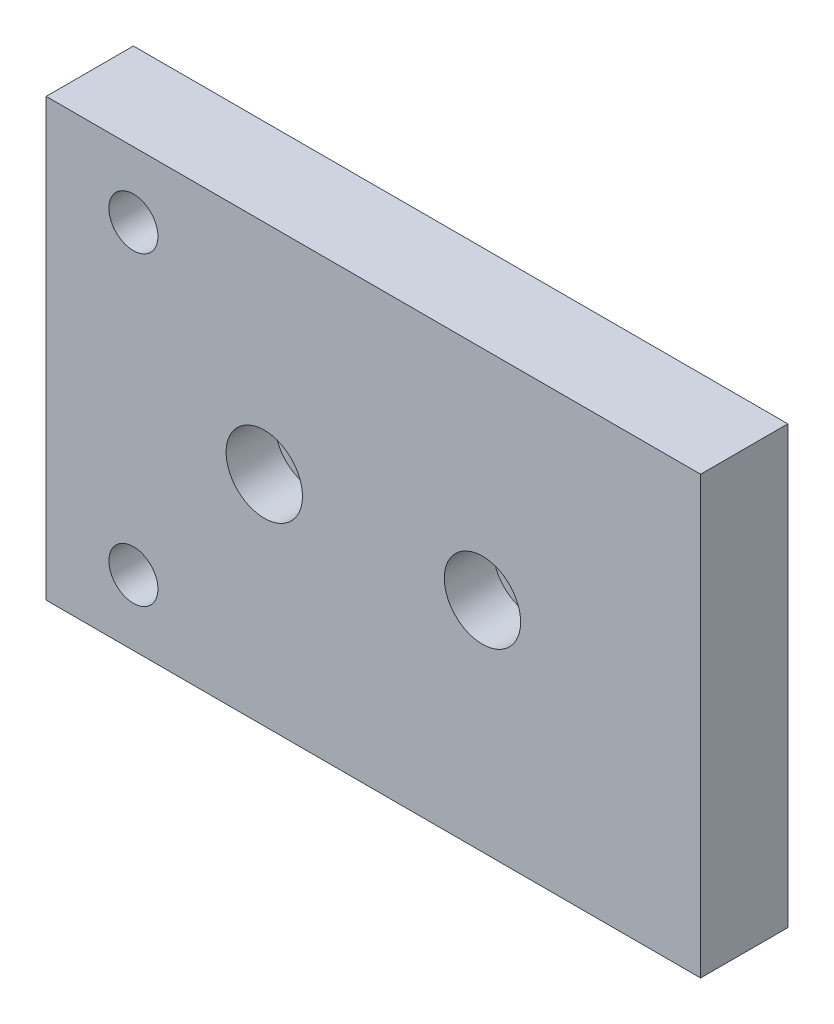
ISO-10303-21;
HEADER;
FILE_DESCRIPTION(('STEP AP214'),'2;1');
FILE_NAME('part.step','',(''),(''),'','','');
FILE_SCHEMA(('AUTOMOTIVE_DESIGN { 1 0 10303 214 1 1 1 1 }'));
ENDSEC;
DATA;
#1=APPLICATION_CONTEXT('core data for automotive mechanical design processes');
#2=APPLICATION_PROTOCOL_DEFINITION('international standard','automotive_design',2000,#1);
#3=PRODUCT_CONTEXT('',#1,'mechanical');
#4=PRODUCT('Part','Part','',(#3));
#5=PRODUCT_RELATED_PRODUCT_CATEGORY('part','',(#4));
#6=PRODUCT_DEFINITION_FORMATION('','',#4);
#7=PRODUCT_DEFINITION_CONTEXT('part definition',#1,'design');
#8=PRODUCT_DEFINITION('design','',#6,#7);
#9=PRODUCT_DEFINITION_SHAPE('','',#8);
#10=(LENGTH_UNIT() NAMED_UNIT(*) SI_UNIT(.MILLI.,.METRE.));
#11=(NAMED_UNIT(*) PLANE_ANGLE_UNIT() SI_UNIT($,.RADIAN.));
#12=(NAMED_UNIT(*) SI_UNIT($,.STERADIAN.) SOLID_ANGLE_UNIT());
#13=UNCERTAINTY_MEASURE_WITH_UNIT(LENGTH_MEASURE(1.E-05),#10,'distance_accuracy_value','');
#14=(GEOMETRIC_REPRESENTATION_CONTEXT(3) GLOBAL_UNCERTAINTY_ASSIGNED_CONTEXT((#13)) GLOBAL_UNIT_ASSIGNED_CONTEXT((#10,
#11,#12)) REPRESENTATION_CONTEXT('',''));
#15=CARTESIAN_POINT('',(0.,0.,0.));
#16=DIRECTION('',(0.,0.,1.));
#17=DIRECTION('',(1.,0.,0.));
#18=AXIS2_PLACEMENT_3D('',#15,#16,#17);
#19=CARTESIAN_POINT('',(0.,0.,12.7));
#20=DIRECTION('',(1.,0.,0.));
#21=DIRECTION('',(0.,0.,-1.));
#22=AXIS2_PLACEMENT_3D('',#19,#20,#21);
#23=PLANE('',#22);
#24=DIRECTION('',(0.,-1.,0.));
#25=VECTOR('',#24,1.);
#26=CARTESIAN_POINT('',(0.,0.,0.));
#27=LINE('',#26,#25);
#28=CARTESIAN_POINT('',(0.,63.5,0.));
#29=VERTEX_POINT('',#28);
#30=CARTESIAN_POINT('',(0.,0.,0.));
#31=VERTEX_POINT('',#30);
#32=EDGE_CURVE('E95',#29,#31,#27,.T.);
#33=ORIENTED_EDGE('',*,*,#32,.T.);
#34=DIRECTION('',(0.,0.,-1.));
#35=VECTOR('',#34,1.);
#36=CARTESIAN_POINT('',(0.,0.,12.7));
#37=LINE('',#36,#35);
#38=CARTESIAN_POINT('',(0.,0.,12.7));
#39=VERTEX_POINT('',#38);
#40=EDGE_CURVE('E11',#39,#31,#37,.T.);
#41=ORIENTED_EDGE('',*,*,#40,.F.);
#42=DIRECTION('',(0.,-1.,0.));
#43=VECTOR('',#42,1.);
#44=CARTESIAN_POINT('',(0.,0.,12.7));
#45=LINE('',#44,#43);
#46=CARTESIAN_POINT('',(0.,63.5,12.7));
#47=VERTEX_POINT('',#46);
#48=EDGE_CURVE('E83',#47,#39,#45,.T.);
#49=ORIENTED_EDGE('',*,*,#48,.F.);
#50=DIRECTION('',(0.,0.,-1.));
#51=VECTOR('',#50,1.);
#52=CARTESIAN_POINT('',(0.,63.5,12.7));
#53=LINE('',#52,#51);
#54=EDGE_CURVE('E91',#47,#29,#53,.T.);
#55=ORIENTED_EDGE('',*,*,#54,.T.);
#56=EDGE_LOOP('',(#33,#41,#49,#55));
#57=FACE_BOUND('',#56,.T.);
#58=ADVANCED_FACE('F32',(#57),#23,.F.);
#59=CARTESIAN_POINT('',(0.,0.,12.7));
#60=DIRECTION('',(0.,1.,0.));
#61=DIRECTION('',(0.,0.,1.));
#62=AXIS2_PLACEMENT_3D('',#59,#60,#61);
#63=PLANE('',#62);
#64=DIRECTION('',(1.,0.,0.));
#65=VECTOR('',#64,1.);
#66=CARTESIAN_POINT('',(0.,0.,0.));
#67=LINE('',#66,#65);
#68=CARTESIAN_POINT('',(95.25,0.,0.));
#69=VERTEX_POINT('',#68);
#70=EDGE_CURVE('E87',#31,#69,#67,.T.);
#71=ORIENTED_EDGE('',*,*,#70,.T.);
#72=DIRECTION('',(0.,0.,-1.));
#73=VECTOR('',#72,1.);
#74=CARTESIAN_POINT('',(95.25,0.,12.7));
#75=LINE('',#74,#73);
#76=CARTESIAN_POINT('',(95.25,0.,12.7));
#77=VERTEX_POINT('',#76);
#78=EDGE_CURVE('E40',#77,#69,#75,.T.);
#79=ORIENTED_EDGE('',*,*,#78,.F.);
#80=DIRECTION('',(1.,0.,0.));
#81=VECTOR('',#80,1.);
#82=CARTESIAN_POINT('',(0.,0.,12.7));
#83=LINE('',#82,#81);
#84=EDGE_CURVE('E78',#39,#77,#83,.T.);
#85=ORIENTED_EDGE('',*,*,#84,.F.);
#86=ORIENTED_EDGE('',*,*,#40,.T.);
#87=EDGE_LOOP('',(#71,#79,#85,#86));
#88=FACE_BOUND('',#87,.T.);
#89=ADVANCED_FACE('F86',(#88),#63,.F.);
#90=CARTESIAN_POINT('',(95.25,0.,12.7));
#91=DIRECTION('',(-1.,0.,0.));
#92=DIRECTION('',(0.,0.,1.));
#93=AXIS2_PLACEMENT_3D('',#90,#91,#92);
#94=PLANE('',#93);
#95=DIRECTION('',(0.,1.,0.));
#96=VECTOR('',#95,1.);
#97=CARTESIAN_POINT('',(95.25,0.,0.));
#98=LINE('',#97,#96);
#99=CARTESIAN_POINT('',(95.25,63.5,0.));
#100=VERTEX_POINT('',#99);
#101=EDGE_CURVE('E65',#69,#100,#98,.T.);
#102=ORIENTED_EDGE('',*,*,#101,.T.);
#103=DIRECTION('',(0.,0.,-1.));
#104=VECTOR('',#103,1.);
#105=CARTESIAN_POINT('',(95.25,63.5,12.7));
#106=LINE('',#105,#104);
#107=CARTESIAN_POINT('',(95.25,63.5,12.7));
#108=VERTEX_POINT('',#107);
#109=EDGE_CURVE('E88',#108,#100,#106,.T.);
#110=ORIENTED_EDGE('',*,*,#109,.F.);
#111=DIRECTION('',(0.,1.,0.));
#112=VECTOR('',#111,1.);
#113=CARTESIAN_POINT('',(95.25,0.,12.7));
#114=LINE('',#113,#112);
#115=EDGE_CURVE('E81',#77,#108,#114,.T.);
#116=ORIENTED_EDGE('',*,*,#115,.F.);
#117=ORIENTED_EDGE('',*,*,#78,.T.);
#118=EDGE_LOOP('',(#102,#110,#116,#117));
#119=FACE_BOUND('',#118,.T.);
#120=ADVANCED_FACE('F89',(#119),#94,.F.);
#121=CARTESIAN_POINT('',(0.,63.5,12.7));
#122=DIRECTION('',(0.,-1.,0.));
#123=DIRECTION('',(0.,0.,-1.));
#124=AXIS2_PLACEMENT_3D('',#121,#122,#123);
#125=PLANE('',#124);
#126=DIRECTION('',(-1.,0.,0.));
#127=VECTOR('',#126,1.);
#128=CARTESIAN_POINT('',(0.,63.5,0.));
#129=LINE('',#128,#127);
#130=EDGE_CURVE('E71',#100,#29,#129,.T.);
#131=ORIENTED_EDGE('',*,*,#130,.T.);
#132=ORIENTED_EDGE('',*,*,#54,.F.);
#133=DIRECTION('',(-1.,0.,0.));
#134=VECTOR('',#133,1.);
#135=CARTESIAN_POINT('',(0.,63.5,12.7));
#136=LINE('',#135,#134);
#137=EDGE_CURVE('E48',#108,#47,#136,.T.);
#138=ORIENTED_EDGE('',*,*,#137,.F.);
#139=ORIENTED_EDGE('',*,*,#109,.T.);
#140=EDGE_LOOP('',(#131,#132,#138,#139));
#141=FACE_BOUND('',#140,.T.);
#142=ADVANCED_FACE('F103',(#141),#125,.F.);
#143=CARTESIAN_POINT('',(0.,63.5,12.7));
#144=DIRECTION('',(0.,0.,-1.));
#145=DIRECTION('',(-1.,0.,0.));
#146=AXIS2_PLACEMENT_3D('',#143,#144,#145);
#147=PLANE('',#146);
#148=CARTESIAN_POINT('',(31.75,31.75,12.7));
#149=DIRECTION('',(0.,0.,1.));
#150=DIRECTION('',(1.,0.,0.));
#151=AXIS2_PLACEMENT_3D('',#148,#149,#150);
#152=CIRCLE('',#151,5.55625);
#153=CARTESIAN_POINT('',(37.30625,31.75,12.7));
#154=VERTEX_POINT('',#153);
#155=EDGE_CURVE('E153',#154,#154,#152,.T.);
#156=ORIENTED_EDGE('',*,*,#155,.F.);
#157=EDGE_LOOP('',(#156));
#158=FACE_BOUND('',#157,.T.);
#159=CARTESIAN_POINT('',(63.5,31.75,12.7));
#160=DIRECTION('',(0.,0.,1.));
#161=DIRECTION('',(1.,0.,0.));
#162=AXIS2_PLACEMENT_3D('',#159,#160,#161);
#163=CIRCLE('',#162,5.55625);
#164=CARTESIAN_POINT('',(69.05625,31.75,12.7));
#165=VERTEX_POINT('',#164);
#166=EDGE_CURVE('E141',#165,#165,#163,.T.);
#167=ORIENTED_EDGE('',*,*,#166,.F.);
#168=EDGE_LOOP('',(#167));
#169=FACE_BOUND('',#168,.T.);
#170=CARTESIAN_POINT('',(12.7,53.975,12.7));
#171=DIRECTION('',(0.,0.,-1.));
#172=DIRECTION('',(-1.,0.,0.));
#173=AXIS2_PLACEMENT_3D('',#170,#171,#172);
#174=CIRCLE('',#173,3.57124);
#175=CARTESIAN_POINT('',(9.12876000000001,53.975,12.7));
#176=VERTEX_POINT('',#175);
#177=EDGE_CURVE('E120',#176,#176,#174,.T.);
#178=ORIENTED_EDGE('',*,*,#177,.T.);
#179=EDGE_LOOP('',(#178));
#180=FACE_BOUND('',#179,.T.);
#181=CARTESIAN_POINT('',(12.7,9.525,12.7));
#182=DIRECTION('',(0.,0.,-1.));
#183=DIRECTION('',(-1.,0.,0.));
#184=AXIS2_PLACEMENT_3D('',#181,#182,#183);
#185=CIRCLE('',#184,3.57124);
#186=CARTESIAN_POINT('',(9.12876,9.525,12.7));
#187=VERTEX_POINT('',#186);
#188=EDGE_CURVE('E98',#187,#187,#185,.T.);
#189=ORIENTED_EDGE('',*,*,#188,.T.);
#190=EDGE_LOOP('',(#189));
#191=FACE_BOUND('',#190,.T.);
#192=ORIENTED_EDGE('',*,*,#48,.T.);
#193=ORIENTED_EDGE('',*,*,#84,.T.);
#194=ORIENTED_EDGE('',*,*,#115,.T.);
#195=ORIENTED_EDGE('',*,*,#137,.T.);
#196=EDGE_LOOP('',(#192,#193,#194,#195));
#197=FACE_BOUND('',#196,.T.);
#198=ADVANCED_FACE('F79',(#158,#169,#180,#191,#197),#147,.F.);
#199=CARTESIAN_POINT('',(0.,63.5,0.));
#200=DIRECTION('',(0.,0.,-1.));
#201=DIRECTION('',(-1.,0.,0.));
#202=AXIS2_PLACEMENT_3D('',#199,#200,#201);
#203=PLANE('',#202);
#204=CARTESIAN_POINT('',(31.75,31.75,0.));
#205=DIRECTION('',(0.,0.,1.));
#206=DIRECTION('',(1.,0.,0.));
#207=AXIS2_PLACEMENT_3D('',#204,#205,#206);
#208=CIRCLE('',#207,3.57124);
#209=CARTESIAN_POINT('',(35.32124,31.75,0.));
#210=VERTEX_POINT('',#209);
#211=EDGE_CURVE('E144',#210,#210,#208,.T.);
#212=ORIENTED_EDGE('',*,*,#211,.T.);
#213=EDGE_LOOP('',(#212));
#214=FACE_BOUND('',#213,.T.);
#215=CARTESIAN_POINT('',(63.5,31.75,0.));
#216=DIRECTION('',(0.,0.,1.));
#217=DIRECTION('',(1.,0.,0.));
#218=AXIS2_PLACEMENT_3D('',#215,#216,#217);
#219=CIRCLE('',#218,3.57124);
#220=CARTESIAN_POINT('',(67.07124,31.75,0.));
#221=VERTEX_POINT('',#220);
#222=EDGE_CURVE('E132',#221,#221,#219,.T.);
#223=ORIENTED_EDGE('',*,*,#222,.T.);
#224=EDGE_LOOP('',(#223));
#225=FACE_BOUND('',#224,.T.);
#226=CARTESIAN_POINT('',(12.7,53.975,0.));
#227=DIRECTION('',(0.,0.,-1.));
#228=DIRECTION('',(-1.,0.,0.));
#229=AXIS2_PLACEMENT_3D('',#226,#227,#228);
#230=CIRCLE('',#229,5.55625);
#231=CARTESIAN_POINT('',(7.14375000000001,53.975,0.));
#232=VERTEX_POINT('',#231);
#233=EDGE_CURVE('E129',#232,#232,#230,.T.);
#234=ORIENTED_EDGE('',*,*,#233,.F.);
#235=EDGE_LOOP('',(#234));
#236=FACE_BOUND('',#235,.T.);
#237=CARTESIAN_POINT('',(12.7,9.525,0.));
#238=DIRECTION('',(0.,0.,-1.));
#239=DIRECTION('',(-1.,0.,0.));
#240=AXIS2_PLACEMENT_3D('',#237,#238,#239);
#241=CIRCLE('',#240,5.55625);
#242=CARTESIAN_POINT('',(7.14375,9.525,0.));
#243=VERTEX_POINT('',#242);
#244=EDGE_CURVE('E117',#243,#243,#241,.T.);
#245=ORIENTED_EDGE('',*,*,#244,.F.);
#246=EDGE_LOOP('',(#245));
#247=FACE_BOUND('',#246,.T.);
#248=ORIENTED_EDGE('',*,*,#32,.F.);
#249=ORIENTED_EDGE('',*,*,#130,.F.);
#250=ORIENTED_EDGE('',*,*,#101,.F.);
#251=ORIENTED_EDGE('',*,*,#70,.F.);
#252=EDGE_LOOP('',(#248,#249,#250,#251));
#253=FACE_BOUND('',#252,.T.);
#254=ADVANCED_FACE('F106',(#214,#225,#236,#247,#253),#203,.T.);
#255=CARTESIAN_POINT('',(12.7,9.525,0.));
#256=DIRECTION('',(0.,0.,-1.));
#257=DIRECTION('',(-1.,0.,0.));
#258=AXIS2_PLACEMENT_3D('',#255,#256,#257);
#259=CYLINDRICAL_SURFACE('',#258,3.57124);
#260=ORIENTED_EDGE('',*,*,#188,.F.);
#261=EDGE_LOOP('',(#260));
#262=FACE_BOUND('',#261,.T.);
#263=CARTESIAN_POINT('',(12.7,9.525,6.35));
#264=DIRECTION('',(0.,0.,-1.));
#265=DIRECTION('',(-1.,0.,0.));
#266=AXIS2_PLACEMENT_3D('',#263,#264,#265);
#267=CIRCLE('',#266,3.57124);
#268=CARTESIAN_POINT('',(9.12876,9.525,6.35));
#269=VERTEX_POINT('',#268);
#270=EDGE_CURVE('E111',#269,#269,#267,.T.);
#271=ORIENTED_EDGE('',*,*,#270,.T.);
#272=EDGE_LOOP('',(#271));
#273=FACE_BOUND('',#272,.T.);
#274=ADVANCED_FACE('F168',(#262,#273),#259,.F.);
#275=CARTESIAN_POINT('',(16.27124,9.525,6.35));
#276=DIRECTION('',(0.,0.,1.));
#277=DIRECTION('',(1.,0.,0.));
#278=AXIS2_PLACEMENT_3D('',#275,#276,#277);
#279=PLANE('',#278);
#280=ORIENTED_EDGE('',*,*,#270,.F.);
#281=EDGE_LOOP('',(#280));
#282=FACE_BOUND('',#281,.T.);
#283=CARTESIAN_POINT('',(12.7,9.525,6.35));
#284=DIRECTION('',(0.,0.,-1.));
#285=DIRECTION('',(-1.,0.,0.));
#286=AXIS2_PLACEMENT_3D('',#283,#284,#285);
#287=CIRCLE('',#286,5.55625);
#288=CARTESIAN_POINT('',(7.14375,9.525,6.35));
#289=VERTEX_POINT('',#288);
#290=EDGE_CURVE('E114',#289,#289,#287,.T.);
#291=ORIENTED_EDGE('',*,*,#290,.T.);
#292=EDGE_LOOP('',(#291));
#293=FACE_BOUND('',#292,.T.);
#294=ADVANCED_FACE('F171',(#282,#293),#279,.F.);
#295=CARTESIAN_POINT('',(12.7,9.525,0.));
#296=DIRECTION('',(0.,0.,-1.));
#297=DIRECTION('',(-1.,0.,0.));
#298=AXIS2_PLACEMENT_3D('',#295,#296,#297);
#299=CYLINDRICAL_SURFACE('',#298,5.55625);
#300=ORIENTED_EDGE('',*,*,#290,.F.);
#301=EDGE_LOOP('',(#300));
#302=FACE_BOUND('',#301,.T.);
#303=ORIENTED_EDGE('',*,*,#244,.T.);
#304=EDGE_LOOP('',(#303));
#305=FACE_BOUND('',#304,.T.);
#306=ADVANCED_FACE('F177',(#302,#305),#299,.F.);
#307=CARTESIAN_POINT('',(12.7,53.975,0.));
#308=DIRECTION('',(0.,0.,-1.));
#309=DIRECTION('',(-1.,0.,0.));
#310=AXIS2_PLACEMENT_3D('',#307,#308,#309);
#311=CYLINDRICAL_SURFACE('',#310,3.57124);
#312=ORIENTED_EDGE('',*,*,#177,.F.);
#313=EDGE_LOOP('',(#312));
#314=FACE_BOUND('',#313,.T.);
#315=CARTESIAN_POINT('',(12.7,53.975,6.35));
#316=DIRECTION('',(0.,0.,-1.));
#317=DIRECTION('',(-1.,0.,0.));
#318=AXIS2_PLACEMENT_3D('',#315,#316,#317);
#319=CIRCLE('',#318,3.57124);
#320=CARTESIAN_POINT('',(9.12876000000001,53.975,6.35));
#321=VERTEX_POINT('',#320);
#322=EDGE_CURVE('E123',#321,#321,#319,.T.);
#323=ORIENTED_EDGE('',*,*,#322,.T.);
#324=EDGE_LOOP('',(#323));
#325=FACE_BOUND('',#324,.T.);
#326=ADVANCED_FACE('F183',(#314,#325),#311,.F.);
#327=CARTESIAN_POINT('',(16.27124,53.975,6.35));
#328=DIRECTION('',(0.,0.,1.));
#329=DIRECTION('',(1.,0.,0.));
#330=AXIS2_PLACEMENT_3D('',#327,#328,#329);
#331=PLANE('',#330);
#332=ORIENTED_EDGE('',*,*,#322,.F.);
#333=EDGE_LOOP('',(#332));
#334=FACE_BOUND('',#333,.T.);
#335=CARTESIAN_POINT('',(12.7,53.975,6.35));
#336=DIRECTION('',(0.,0.,-1.));
#337=DIRECTION('',(-1.,0.,0.));
#338=AXIS2_PLACEMENT_3D('',#335,#336,#337);
#339=CIRCLE('',#338,5.55625);
#340=CARTESIAN_POINT('',(7.14375000000001,53.975,6.35));
#341=VERTEX_POINT('',#340);
#342=EDGE_CURVE('E126',#341,#341,#339,.T.);
#343=ORIENTED_EDGE('',*,*,#342,.T.);
#344=EDGE_LOOP('',(#343));
#345=FACE_BOUND('',#344,.T.);
#346=ADVANCED_FACE('F289',(#334,#345),#331,.F.);
#347=CARTESIAN_POINT('',(12.7,53.975,0.));
#348=DIRECTION('',(0.,0.,-1.));
#349=DIRECTION('',(-1.,0.,0.));
#350=AXIS2_PLACEMENT_3D('',#347,#348,#349);
#351=CYLINDRICAL_SURFACE('',#350,5.55625);
#352=ORIENTED_EDGE('',*,*,#342,.F.);
#353=EDGE_LOOP('',(#352));
#354=FACE_BOUND('',#353,.T.);
#355=ORIENTED_EDGE('',*,*,#233,.T.);
#356=EDGE_LOOP('',(#355));
#357=FACE_BOUND('',#356,.T.);
#358=ADVANCED_FACE('F218',(#354,#357),#351,.F.);
#359=CARTESIAN_POINT('',(63.5,31.75,12.7));
#360=DIRECTION('',(0.,0.,1.));
#361=DIRECTION('',(1.,0.,0.));
#362=AXIS2_PLACEMENT_3D('',#359,#360,#361);
#363=CYLINDRICAL_SURFACE('',#362,3.57124);
#364=ORIENTED_EDGE('',*,*,#222,.F.);
#365=EDGE_LOOP('',(#364));
#366=FACE_BOUND('',#365,.T.);
#367=CARTESIAN_POINT('',(63.5,31.75,5.588));
#368=DIRECTION('',(0.,0.,1.));
#369=DIRECTION('',(1.,0.,0.));
#370=AXIS2_PLACEMENT_3D('',#367,#368,#369);
#371=CIRCLE('',#370,3.57124);
#372=CARTESIAN_POINT('',(67.07124,31.75,5.588));
#373=VERTEX_POINT('',#372);
#374=EDGE_CURVE('E135',#373,#373,#371,.T.);
#375=ORIENTED_EDGE('',*,*,#374,.T.);
#376=EDGE_LOOP('',(#375));
#377=FACE_BOUND('',#376,.T.);
#378=ADVANCED_FACE('F228',(#366,#377),#363,.F.);
#379=CARTESIAN_POINT('',(67.07124,31.75,5.588));
#380=DIRECTION('',(0.,0.,-1.));
#381=DIRECTION('',(-1.,0.,0.));
#382=AXIS2_PLACEMENT_3D('',#379,#380,#381);
#383=PLANE('',#382);
#384=ORIENTED_EDGE('',*,*,#374,.F.);
#385=EDGE_LOOP('',(#384));
#386=FACE_BOUND('',#385,.T.);
#387=CARTESIAN_POINT('',(63.5,31.75,5.588));
#388=DIRECTION('',(0.,0.,1.));
#389=DIRECTION('',(1.,0.,0.));
#390=AXIS2_PLACEMENT_3D('',#387,#388,#389);
#391=CIRCLE('',#390,5.55625);
#392=CARTESIAN_POINT('',(69.05625,31.75,5.588));
#393=VERTEX_POINT('',#392);
#394=EDGE_CURVE('E138',#393,#393,#391,.T.);
#395=ORIENTED_EDGE('',*,*,#394,.T.);
#396=EDGE_LOOP('',(#395));
#397=FACE_BOUND('',#396,.T.);
#398=ADVANCED_FACE('F233',(#386,#397),#383,.F.);
#399=CARTESIAN_POINT('',(63.5,31.75,12.7));
#400=DIRECTION('',(0.,0.,1.));
#401=DIRECTION('',(1.,0.,0.));
#402=AXIS2_PLACEMENT_3D('',#399,#400,#401);
#403=CYLINDRICAL_SURFACE('',#402,5.55625);
#404=ORIENTED_EDGE('',*,*,#394,.F.);
#405=EDGE_LOOP('',(#404));
#406=FACE_BOUND('',#405,.T.);
#407=ORIENTED_EDGE('',*,*,#166,.T.);
#408=EDGE_LOOP('',(#407));
#409=FACE_BOUND('',#408,.T.);
#410=ADVANCED_FACE('F243',(#406,#409),#403,.F.);
#411=CARTESIAN_POINT('',(31.75,31.75,12.7));
#412=DIRECTION('',(0.,0.,1.));
#413=DIRECTION('',(1.,0.,0.));
#414=AXIS2_PLACEMENT_3D('',#411,#412,#413);
#415=CYLINDRICAL_SURFACE('',#414,3.57124);
#416=ORIENTED_EDGE('',*,*,#211,.F.);
#417=EDGE_LOOP('',(#416));
#418=FACE_BOUND('',#417,.T.);
#419=CARTESIAN_POINT('',(31.75,31.75,5.588));
#420=DIRECTION('',(0.,0.,1.));
#421=DIRECTION('',(1.,0.,0.));
#422=AXIS2_PLACEMENT_3D('',#419,#420,#421);
#423=CIRCLE('',#422,3.57124);
#424=CARTESIAN_POINT('',(35.32124,31.75,5.588));
#425=VERTEX_POINT('',#424);
#426=EDGE_CURVE('E147',#425,#425,#423,.T.);
#427=ORIENTED_EDGE('',*,*,#426,.T.);
#428=EDGE_LOOP('',(#427));
#429=FACE_BOUND('',#428,.T.);
#430=ADVANCED_FACE('F253',(#418,#429),#415,.F.);
#431=CARTESIAN_POINT('',(35.32124,31.75,5.588));
#432=DIRECTION('',(0.,0.,-1.));
#433=DIRECTION('',(-1.,0.,0.));
#434=AXIS2_PLACEMENT_3D('',#431,#432,#433);
#435=PLANE('',#434);
#436=ORIENTED_EDGE('',*,*,#426,.F.);
#437=EDGE_LOOP('',(#436));
#438=FACE_BOUND('',#437,.T.);
#439=CARTESIAN_POINT('',(31.75,31.75,5.588));
#440=DIRECTION('',(0.,0.,1.));
#441=DIRECTION('',(1.,0.,0.));
#442=AXIS2_PLACEMENT_3D('',#439,#440,#441);
#443=CIRCLE('',#442,5.55625);
#444=CARTESIAN_POINT('',(37.30625,31.75,5.588));
#445=VERTEX_POINT('',#444);
#446=EDGE_CURVE('E150',#445,#445,#443,.T.);
#447=ORIENTED_EDGE('',*,*,#446,.T.);
#448=EDGE_LOOP('',(#447));
#449=FACE_BOUND('',#448,.T.);
#450=ADVANCED_FACE('F263',(#438,#449),#435,.F.);
#451=CARTESIAN_POINT('',(31.75,31.75,12.7));
#452=DIRECTION('',(0.,0.,1.));
#453=DIRECTION('',(1.,0.,0.));
#454=AXIS2_PLACEMENT_3D('',#451,#452,#453);
#455=CYLINDRICAL_SURFACE('',#454,5.55625);
#456=ORIENTED_EDGE('',*,*,#446,.F.);
#457=EDGE_LOOP('',(#456));
#458=FACE_BOUND('',#457,.T.);
#459=ORIENTED_EDGE('',*,*,#155,.T.);
#460=EDGE_LOOP('',(#459));
#461=FACE_BOUND('',#460,.T.);
#462=ADVANCED_FACE('F157',(#458,#461),#455,.F.);
#463=CLOSED_SHELL('',(#58,#89,#120,#142,#198,#254,#274,#294,#306,#326,#346,#358,#378,#398,#410,
#430,#450,#462));
#464=MANIFOLD_SOLID_BREP('B2',#463);
#465=ADVANCED_BREP_SHAPE_REPRESENTATION('',(#18,#464),#14);
#466=SHAPE_DEFINITION_REPRESENTATION(#9,#465);
ENDSEC;
END-ISO-10303-21;
